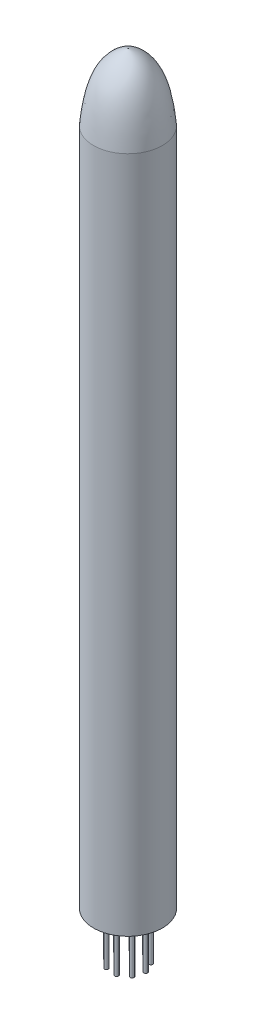
ISO-10303-21;
HEADER;
FILE_DESCRIPTION(('STEP AP214'),'2;1');
FILE_NAME('part.step','',(''),(''),'','','');
FILE_SCHEMA(('AUTOMOTIVE_DESIGN { 1 0 10303 214 1 1 1 1 }'));
ENDSEC;
DATA;
#1=APPLICATION_CONTEXT('core data for automotive mechanical design processes');
#2=APPLICATION_PROTOCOL_DEFINITION('international standard','automotive_design',2000,#1);
#3=PRODUCT_CONTEXT('',#1,'mechanical');
#4=PRODUCT('Part','Part','',(#3));
#5=PRODUCT_RELATED_PRODUCT_CATEGORY('part','',(#4));
#6=PRODUCT_DEFINITION_FORMATION('','',#4);
#7=PRODUCT_DEFINITION_CONTEXT('part definition',#1,'design');
#8=PRODUCT_DEFINITION('design','',#6,#7);
#9=PRODUCT_DEFINITION_SHAPE('','',#8);
#10=(LENGTH_UNIT() NAMED_UNIT(*) SI_UNIT(.MILLI.,.METRE.));
#11=(NAMED_UNIT(*) PLANE_ANGLE_UNIT() SI_UNIT($,.RADIAN.));
#12=(NAMED_UNIT(*) SI_UNIT($,.STERADIAN.) SOLID_ANGLE_UNIT());
#13=UNCERTAINTY_MEASURE_WITH_UNIT(LENGTH_MEASURE(1.E-05),#10,'distance_accuracy_value','');
#14=(GEOMETRIC_REPRESENTATION_CONTEXT(3) GLOBAL_UNCERTAINTY_ASSIGNED_CONTEXT((#13)) GLOBAL_UNIT_ASSIGNED_CONTEXT((#10,
#11,#12)) REPRESENTATION_CONTEXT('',''));
#15=CARTESIAN_POINT('',(0.,0.,0.));
#16=DIRECTION('',(0.,0.,1.));
#17=DIRECTION('',(1.,0.,0.));
#18=AXIS2_PLACEMENT_3D('',#15,#16,#17);
#19=CARTESIAN_POINT('',(-3.6,0.,0.));
#20=DIRECTION('',(0.,-1.,0.));
#21=DIRECTION('',(1.,0.,0.));
#22=AXIS2_PLACEMENT_3D('',#19,#20,#21);
#23=PLANE('',#22);
#24=CARTESIAN_POINT('',(1.190992427399,0.,-1.21306926342985));
#25=DIRECTION('',(0.,-1.,0.));
#26=DIRECTION('',(0.17364817766694,0.,0.984807753012206));
#27=AXIS2_PLACEMENT_3D('',#24,#25,#26);
#28=CIRCLE('',#27,0.2);
#29=CARTESIAN_POINT('',(1.22572206293239,0.,-1.01610771282741));
#30=VERTEX_POINT('',#29);
#31=EDGE_CURVE('E142',#30,#30,#28,.T.);
#32=ORIENTED_EDGE('',*,*,#31,.F.);
#33=EDGE_LOOP('',(#32));
#34=FACE_BOUND('',#33,.T.);
#35=CARTESIAN_POINT('',(1.40145368019947,0.,0.962251309303013));
#36=DIRECTION('',(0.,-1.,0.));
#37=DIRECTION('',(-0.939692620785906,0.,0.342020143325676));
#38=AXIS2_PLACEMENT_3D('',#35,#36,#37);
#39=CIRCLE('',#38,0.2);
#40=CARTESIAN_POINT('',(1.21351515604229,0.,1.03065533796815));
#41=VERTEX_POINT('',#40);
#42=EDGE_CURVE('E157',#41,#41,#39,.T.);
#43=ORIENTED_EDGE('',*,*,#42,.F.);
#44=EDGE_LOOP('',(#43));
#45=FACE_BOUND('',#44,.T.);
#46=CARTESIAN_POINT('',(-0.704272672096509,0.,1.54725563606601));
#47=DIRECTION('',(0.,-1.,0.));
#48=DIRECTION('',(-0.500000000000004,0.,-0.866025403784436));
#49=AXIS2_PLACEMENT_3D('',#46,#47,#48);
#50=CIRCLE('',#49,0.2);
#51=CARTESIAN_POINT('',(-0.80427267209651,0.,1.37405055530913));
#52=VERTEX_POINT('',#51);
#53=EDGE_CURVE('E169',#52,#52,#50,.T.);
#54=ORIENTED_EDGE('',*,*,#53,.F.);
#55=EDGE_LOOP('',(#54));
#56=FACE_BOUND('',#55,.T.);
#57=CARTESIAN_POINT('',(-1.64604501237982,0.,-0.424895066127521));
#58=DIRECTION('',(0.,-1.,0.));
#59=DIRECTION('',(0.766044443118977,0.,-0.642787609686541));
#60=AXIS2_PLACEMENT_3D('',#57,#58,#59);
#61=CIRCLE('',#60,0.2);
#62=CARTESIAN_POINT('',(-1.49283612375603,0.,-0.55345258806483));
#63=VERTEX_POINT('',#62);
#64=EDGE_CURVE('E181',#63,#63,#61,.T.);
#65=ORIENTED_EDGE('',*,*,#64,.F.);
#66=EDGE_LOOP('',(#65));
#67=FACE_BOUND('',#66,.T.);
#68=CARTESIAN_POINT('',(0.,0.,0.));
#69=DIRECTION('',(0.,1.,0.));
#70=DIRECTION('',(-1.,0.,0.));
#71=AXIS2_PLACEMENT_3D('',#68,#69,#70);
#72=CIRCLE('',#71,3.6);
#73=CARTESIAN_POINT('',(-3.6,0.,0.));
#74=VERTEX_POINT('',#73);
#75=EDGE_CURVE('E46',#74,#74,#72,.T.);
#76=ORIENTED_EDGE('',*,*,#75,.F.);
#77=EDGE_LOOP('',(#76));
#78=FACE_BOUND('',#77,.T.);
#79=CARTESIAN_POINT('',(-0.987826350933557,0.,-1.38354584325974));
#80=DIRECTION('',(0.,-1.,0.));
#81=DIRECTION('',(1.,0.,0.));
#82=AXIS2_PLACEMENT_3D('',#79,#80,#81);
#83=CIRCLE('',#82,0.2);
#84=CARTESIAN_POINT('',(-0.787826350933557,0.,-1.38354584325974));
#85=VERTEX_POINT('',#84);
#86=EDGE_CURVE('E187',#85,#85,#83,.T.);
#87=ORIENTED_EDGE('',*,*,#86,.F.);
#88=EDGE_LOOP('',(#87));
#89=FACE_BOUND('',#88,.T.);
#90=CARTESIAN_POINT('',(-1.53406091878098,0.,0.73256883462842));
#91=DIRECTION('',(0.,-1.,0.));
#92=DIRECTION('',(0.173648177666927,0.,-0.984807753012209));
#93=AXIS2_PLACEMENT_3D('',#90,#91,#92);
#94=CIRCLE('',#93,0.2);
#95=CARTESIAN_POINT('',(-1.4993312832476,0.,0.535607284025978));
#96=VERTEX_POINT('',#95);
#97=EDGE_CURVE('E175',#96,#96,#94,.T.);
#98=ORIENTED_EDGE('',*,*,#97,.F.);
#99=EDGE_LOOP('',(#98));
#100=FACE_BOUND('',#99,.T.);
#101=CARTESIAN_POINT('',(0.455052584980816,0.,1.63796432955736));
#102=DIRECTION('',(0.,-1.,0.));
#103=DIRECTION('',(-0.939692620785911,0.,-0.342020143325663));
#104=AXIS2_PLACEMENT_3D('',#101,#102,#103);
#105=CIRCLE('',#104,0.2);
#106=CARTESIAN_POINT('',(0.267114060823634,0.,1.56956030089222));
#107=VERTEX_POINT('',#106);
#108=EDGE_CURVE('E163',#107,#107,#105,.T.);
#109=ORIENTED_EDGE('',*,*,#108,.F.);
#110=EDGE_LOOP('',(#109));
#111=FACE_BOUND('',#110,.T.);
#112=CARTESIAN_POINT('',(1.69209902303007,0.,-0.16370979280629));
#113=DIRECTION('',(0.,-1.,0.));
#114=DIRECTION('',(-0.499999999999992,0.,0.866025403784443));
#115=AXIS2_PLACEMENT_3D('',#112,#113,#114);
#116=CIRCLE('',#115,0.2);
#117=CARTESIAN_POINT('',(1.59209902303007,0.,0.0094952879505989));
#118=VERTEX_POINT('',#117);
#119=EDGE_CURVE('E152',#118,#118,#116,.T.);
#120=ORIENTED_EDGE('',*,*,#119,.F.);
#121=EDGE_LOOP('',(#120));
#122=FACE_BOUND('',#121,.T.);
#123=CARTESIAN_POINT('',(0.132607238581504,0.,-1.69482014393144));
#124=DIRECTION('',(0.,-1.,0.));
#125=DIRECTION('',(0.766044443118986,0.,0.64278760968653));
#126=AXIS2_PLACEMENT_3D('',#123,#124,#125);
#127=CIRCLE('',#126,0.2);
#128=CARTESIAN_POINT('',(0.285816127205301,0.,-1.56626262199413));
#129=VERTEX_POINT('',#128);
#130=EDGE_CURVE('E143',#129,#129,#127,.T.);
#131=ORIENTED_EDGE('',*,*,#130,.F.);
#132=EDGE_LOOP('',(#131));
#133=FACE_BOUND('',#132,.T.);
#134=ADVANCED_FACE('F38',(#34,#45,#56,#67,#78,#89,#100,#111,#122,#133),#23,.T.);
#135=CARTESIAN_POINT('',(0.,78.,0.));
#136=CARTESIAN_POINT('',(-2.93162040251302,77.0762935384002,0.));
#137=CARTESIAN_POINT('',(-3.33793778275533,73.5516801073989,0.));
#138=CARTESIAN_POINT('',(-3.60000000000001,71.,0.));
#139=B_SPLINE_CURVE_WITH_KNOTS('',3,(#135,#136,#137,#138),.UNSPECIFIED.,.F.,.F.,(4,4),(0.,1.),.UNSPECIFIED.);
#140=CARTESIAN_POINT('',(0.,8.26332855790539,0.));
#141=DIRECTION('',(0.,1.,0.));
#142=AXIS1_PLACEMENT('',#140,#141);
#143=SURFACE_OF_REVOLUTION('',#139,#142);
#144=CARTESIAN_POINT('',(0.,71.,0.));
#145=DIRECTION('',(0.,1.,0.));
#146=DIRECTION('',(-1.,0.,0.));
#147=AXIS2_PLACEMENT_3D('',#144,#145,#146);
#148=CIRCLE('',#147,3.6);
#149=CARTESIAN_POINT('',(-3.60000000000001,71.,0.));
#150=VERTEX_POINT('',#149);
#151=EDGE_CURVE('E11',#150,#150,#148,.T.);
#152=ORIENTED_EDGE('',*,*,#151,.T.);
#153=EDGE_LOOP('',(#152));
#154=FACE_BOUND('',#153,.T.);
#155=CARTESIAN_POINT('',(0.,78.,0.));
#156=VERTEX_POINT('',#155);
#157=VERTEX_LOOP('',#156);
#158=FACE_BOUND('',#157,.T.);
#159=ADVANCED_FACE('F40',(#154,#158),#143,.F.);
#160=CARTESIAN_POINT('',(0.,8.26332855790539,0.));
#161=DIRECTION('',(0.,1.,0.));
#162=DIRECTION('',(-1.,0.,0.));
#163=AXIS2_PLACEMENT_3D('',#160,#161,#162);
#164=CYLINDRICAL_SURFACE('',#163,3.6);
#165=ORIENTED_EDGE('',*,*,#75,.T.);
#166=EDGE_LOOP('',(#165));
#167=FACE_BOUND('',#166,.T.);
#168=ORIENTED_EDGE('',*,*,#151,.F.);
#169=EDGE_LOOP('',(#168));
#170=FACE_BOUND('',#169,.T.);
#171=ADVANCED_FACE('F50',(#167,#170),#164,.T.);
#172=CARTESIAN_POINT('',(-0.987826350933556,-5.,-1.38354584325974));
#173=DIRECTION('',(0.,1.,0.));
#174=DIRECTION('',(-1.,0.,0.));
#175=AXIS2_PLACEMENT_3D('',#172,#173,#174);
#176=CYLINDRICAL_SURFACE('',#175,0.2);
#177=CARTESIAN_POINT('',(-0.987826350933556,-5.,-1.38354584325974));
#178=DIRECTION('',(0.,-1.,0.));
#179=DIRECTION('',(1.,0.,0.));
#180=AXIS2_PLACEMENT_3D('',#177,#178,#179);
#181=CIRCLE('',#180,0.2);
#182=CARTESIAN_POINT('',(-0.787826350933556,-5.,-1.38354584325974));
#183=VERTEX_POINT('',#182);
#184=EDGE_CURVE('E190',#183,#183,#181,.T.);
#185=ORIENTED_EDGE('',*,*,#184,.F.);
#186=EDGE_LOOP('',(#185));
#187=FACE_BOUND('',#186,.T.);
#188=ORIENTED_EDGE('',*,*,#86,.T.);
#189=EDGE_LOOP('',(#188));
#190=FACE_BOUND('',#189,.T.);
#191=ADVANCED_FACE('F56',(#187,#190),#176,.T.);
#192=CARTESIAN_POINT('',(-0.987826350933556,-5.,-1.38354584325974));
#193=DIRECTION('',(0.,-1.,0.));
#194=DIRECTION('',(1.,0.,0.));
#195=AXIS2_PLACEMENT_3D('',#192,#193,#194);
#196=PLANE('',#195);
#197=ORIENTED_EDGE('',*,*,#184,.T.);
#198=EDGE_LOOP('',(#197));
#199=FACE_BOUND('',#198,.T.);
#200=ADVANCED_FACE('F69',(#199),#196,.T.);
#201=CARTESIAN_POINT('',(-1.64604501237982,-5.,-0.424895066127522));
#202=DIRECTION('',(0.,1.,0.));
#203=DIRECTION('',(-1.,0.,0.));
#204=AXIS2_PLACEMENT_3D('',#201,#202,#203);
#205=CYLINDRICAL_SURFACE('',#204,0.2);
#206=CARTESIAN_POINT('',(-1.64604501237982,-5.,-0.424895066127522));
#207=DIRECTION('',(0.,-1.,0.));
#208=DIRECTION('',(0.766044443118977,0.,-0.642787609686541));
#209=AXIS2_PLACEMENT_3D('',#206,#207,#208);
#210=CIRCLE('',#209,0.2);
#211=CARTESIAN_POINT('',(-1.49283612375603,-5.,-0.55345258806483));
#212=VERTEX_POINT('',#211);
#213=EDGE_CURVE('E184',#212,#212,#210,.T.);
#214=ORIENTED_EDGE('',*,*,#213,.F.);
#215=EDGE_LOOP('',(#214));
#216=FACE_BOUND('',#215,.T.);
#217=ORIENTED_EDGE('',*,*,#64,.T.);
#218=EDGE_LOOP('',(#217));
#219=FACE_BOUND('',#218,.T.);
#220=ADVANCED_FACE('F73',(#216,#219),#205,.T.);
#221=CARTESIAN_POINT('',(-1.64604501237982,-5.,-0.424895066127522));
#222=DIRECTION('',(0.,-1.,0.));
#223=DIRECTION('',(0.766044443118977,0.,-0.642787609686541));
#224=AXIS2_PLACEMENT_3D('',#221,#222,#223);
#225=PLANE('',#224);
#226=ORIENTED_EDGE('',*,*,#213,.T.);
#227=EDGE_LOOP('',(#226));
#228=FACE_BOUND('',#227,.T.);
#229=ADVANCED_FACE('F77',(#228),#225,.T.);
#230=CARTESIAN_POINT('',(-1.53406091878098,-5.,0.732568834628419));
#231=DIRECTION('',(0.,1.,0.));
#232=DIRECTION('',(0.,0.,1.));
#233=AXIS2_PLACEMENT_3D('',#230,#231,#232);
#234=CYLINDRICAL_SURFACE('',#233,0.2);
#235=CARTESIAN_POINT('',(-1.53406091878098,-5.,0.732568834628419));
#236=DIRECTION('',(0.,-1.,0.));
#237=DIRECTION('',(0.173648177666927,0.,-0.984807753012209));
#238=AXIS2_PLACEMENT_3D('',#235,#236,#237);
#239=CIRCLE('',#238,0.2);
#240=CARTESIAN_POINT('',(-1.4993312832476,-5.,0.535607284025977));
#241=VERTEX_POINT('',#240);
#242=EDGE_CURVE('E178',#241,#241,#239,.T.);
#243=ORIENTED_EDGE('',*,*,#242,.F.);
#244=EDGE_LOOP('',(#243));
#245=FACE_BOUND('',#244,.T.);
#246=ORIENTED_EDGE('',*,*,#97,.T.);
#247=EDGE_LOOP('',(#246));
#248=FACE_BOUND('',#247,.T.);
#249=ADVANCED_FACE('F81',(#245,#248),#234,.T.);
#250=CARTESIAN_POINT('',(-1.53406091878098,-5.,0.732568834628419));
#251=DIRECTION('',(0.,-1.,0.));
#252=DIRECTION('',(0.173648177666927,0.,-0.984807753012209));
#253=AXIS2_PLACEMENT_3D('',#250,#251,#252);
#254=PLANE('',#253);
#255=ORIENTED_EDGE('',*,*,#242,.T.);
#256=EDGE_LOOP('',(#255));
#257=FACE_BOUND('',#256,.T.);
#258=ADVANCED_FACE('F85',(#257),#254,.T.);
#259=CARTESIAN_POINT('',(-0.704272672096509,-5.,1.54725563606601));
#260=DIRECTION('',(0.,1.,0.));
#261=DIRECTION('',(0.,0.,1.));
#262=AXIS2_PLACEMENT_3D('',#259,#260,#261);
#263=CYLINDRICAL_SURFACE('',#262,0.2);
#264=CARTESIAN_POINT('',(-0.704272672096509,-5.,1.54725563606601));
#265=DIRECTION('',(0.,-1.,0.));
#266=DIRECTION('',(-0.500000000000004,0.,-0.866025403784436));
#267=AXIS2_PLACEMENT_3D('',#264,#265,#266);
#268=CIRCLE('',#267,0.2);
#269=CARTESIAN_POINT('',(-0.80427267209651,-5.,1.37405055530913));
#270=VERTEX_POINT('',#269);
#271=EDGE_CURVE('E172',#270,#270,#268,.T.);
#272=ORIENTED_EDGE('',*,*,#271,.F.);
#273=EDGE_LOOP('',(#272));
#274=FACE_BOUND('',#273,.T.);
#275=ORIENTED_EDGE('',*,*,#53,.T.);
#276=EDGE_LOOP('',(#275));
#277=FACE_BOUND('',#276,.T.);
#278=ADVANCED_FACE('F89',(#274,#277),#263,.T.);
#279=CARTESIAN_POINT('',(-0.704272672096509,-5.,1.54725563606601));
#280=DIRECTION('',(0.,-1.,0.));
#281=DIRECTION('',(-0.500000000000004,0.,-0.866025403784436));
#282=AXIS2_PLACEMENT_3D('',#279,#280,#281);
#283=PLANE('',#282);
#284=ORIENTED_EDGE('',*,*,#271,.T.);
#285=EDGE_LOOP('',(#284));
#286=FACE_BOUND('',#285,.T.);
#287=ADVANCED_FACE('F93',(#286),#283,.T.);
#288=CARTESIAN_POINT('',(0.455052584980816,-5.,1.63796432955736));
#289=DIRECTION('',(0.,1.,0.));
#290=DIRECTION('',(-1.,0.,0.));
#291=AXIS2_PLACEMENT_3D('',#288,#289,#290);
#292=CYLINDRICAL_SURFACE('',#291,0.2);
#293=CARTESIAN_POINT('',(0.455052584980816,-5.,1.63796432955736));
#294=DIRECTION('',(0.,-1.,0.));
#295=DIRECTION('',(-0.939692620785911,0.,-0.342020143325663));
#296=AXIS2_PLACEMENT_3D('',#293,#294,#295);
#297=CIRCLE('',#296,0.2);
#298=CARTESIAN_POINT('',(0.267114060823633,-5.,1.56956030089222));
#299=VERTEX_POINT('',#298);
#300=EDGE_CURVE('E166',#299,#299,#297,.T.);
#301=ORIENTED_EDGE('',*,*,#300,.F.);
#302=EDGE_LOOP('',(#301));
#303=FACE_BOUND('',#302,.T.);
#304=ORIENTED_EDGE('',*,*,#108,.T.);
#305=EDGE_LOOP('',(#304));
#306=FACE_BOUND('',#305,.T.);
#307=ADVANCED_FACE('F97',(#303,#306),#292,.T.);
#308=CARTESIAN_POINT('',(0.455052584980816,-5.,1.63796432955736));
#309=DIRECTION('',(0.,-1.,0.));
#310=DIRECTION('',(-0.939692620785911,0.,-0.342020143325663));
#311=AXIS2_PLACEMENT_3D('',#308,#309,#310);
#312=PLANE('',#311);
#313=ORIENTED_EDGE('',*,*,#300,.T.);
#314=EDGE_LOOP('',(#313));
#315=FACE_BOUND('',#314,.T.);
#316=ADVANCED_FACE('F101',(#315),#312,.T.);
#317=CARTESIAN_POINT('',(1.40145368019947,-5.,0.962251309303013));
#318=DIRECTION('',(0.,1.,0.));
#319=DIRECTION('',(-1.,0.,0.));
#320=AXIS2_PLACEMENT_3D('',#317,#318,#319);
#321=CYLINDRICAL_SURFACE('',#320,0.2);
#322=CARTESIAN_POINT('',(1.40145368019947,-5.,0.962251309303013));
#323=DIRECTION('',(0.,-1.,0.));
#324=DIRECTION('',(-0.939692620785906,0.,0.342020143325676));
#325=AXIS2_PLACEMENT_3D('',#322,#323,#324);
#326=CIRCLE('',#325,0.2);
#327=CARTESIAN_POINT('',(1.21351515604229,-5.,1.03065533796815));
#328=VERTEX_POINT('',#327);
#329=EDGE_CURVE('E160',#328,#328,#326,.T.);
#330=ORIENTED_EDGE('',*,*,#329,.F.);
#331=EDGE_LOOP('',(#330));
#332=FACE_BOUND('',#331,.T.);
#333=ORIENTED_EDGE('',*,*,#42,.T.);
#334=EDGE_LOOP('',(#333));
#335=FACE_BOUND('',#334,.T.);
#336=ADVANCED_FACE('F105',(#332,#335),#321,.T.);
#337=CARTESIAN_POINT('',(1.40145368019947,-5.,0.962251309303013));
#338=DIRECTION('',(0.,-1.,0.));
#339=DIRECTION('',(-0.939692620785906,0.,0.342020143325676));
#340=AXIS2_PLACEMENT_3D('',#337,#338,#339);
#341=PLANE('',#340);
#342=ORIENTED_EDGE('',*,*,#329,.T.);
#343=EDGE_LOOP('',(#342));
#344=FACE_BOUND('',#343,.T.);
#345=ADVANCED_FACE('F109',(#344),#341,.T.);
#346=CARTESIAN_POINT('',(1.69209902303007,-5.,-0.163709792806289));
#347=DIRECTION('',(0.,1.,0.));
#348=DIRECTION('',(0.,0.,1.));
#349=AXIS2_PLACEMENT_3D('',#346,#347,#348);
#350=CYLINDRICAL_SURFACE('',#349,0.2);
#351=CARTESIAN_POINT('',(1.69209902303007,-5.,-0.163709792806289));
#352=DIRECTION('',(0.,-1.,0.));
#353=DIRECTION('',(-0.499999999999992,0.,0.866025403784443));
#354=AXIS2_PLACEMENT_3D('',#351,#352,#353);
#355=CIRCLE('',#354,0.2);
#356=CARTESIAN_POINT('',(1.59209902303007,-5.,0.00949528795059947));
#357=VERTEX_POINT('',#356);
#358=EDGE_CURVE('E154',#357,#357,#355,.T.);
#359=ORIENTED_EDGE('',*,*,#358,.F.);
#360=EDGE_LOOP('',(#359));
#361=FACE_BOUND('',#360,.T.);
#362=ORIENTED_EDGE('',*,*,#119,.T.);
#363=EDGE_LOOP('',(#362));
#364=FACE_BOUND('',#363,.T.);
#365=ADVANCED_FACE('F113',(#361,#364),#350,.T.);
#366=CARTESIAN_POINT('',(1.69209902303007,-5.,-0.163709792806289));
#367=DIRECTION('',(0.,-1.,0.));
#368=DIRECTION('',(-0.499999999999992,0.,0.866025403784443));
#369=AXIS2_PLACEMENT_3D('',#366,#367,#368);
#370=PLANE('',#369);
#371=ORIENTED_EDGE('',*,*,#358,.T.);
#372=EDGE_LOOP('',(#371));
#373=FACE_BOUND('',#372,.T.);
#374=ADVANCED_FACE('F117',(#373),#370,.T.);
#375=CARTESIAN_POINT('',(1.190992427399,-5.,-1.21306926342985));
#376=DIRECTION('',(0.,1.,0.));
#377=DIRECTION('',(0.,0.,1.));
#378=AXIS2_PLACEMENT_3D('',#375,#376,#377);
#379=CYLINDRICAL_SURFACE('',#378,0.2);
#380=CARTESIAN_POINT('',(1.190992427399,-5.,-1.21306926342985));
#381=DIRECTION('',(0.,-1.,0.));
#382=DIRECTION('',(0.17364817766694,0.,0.984807753012206));
#383=AXIS2_PLACEMENT_3D('',#380,#381,#382);
#384=CIRCLE('',#383,0.2);
#385=CARTESIAN_POINT('',(1.22572206293239,-5.,-1.0161077128274));
#386=VERTEX_POINT('',#385);
#387=EDGE_CURVE('E146',#386,#386,#384,.T.);
#388=ORIENTED_EDGE('',*,*,#387,.F.);
#389=EDGE_LOOP('',(#388));
#390=FACE_BOUND('',#389,.T.);
#391=ORIENTED_EDGE('',*,*,#31,.T.);
#392=EDGE_LOOP('',(#391));
#393=FACE_BOUND('',#392,.T.);
#394=ADVANCED_FACE('F121',(#390,#393),#379,.T.);
#395=CARTESIAN_POINT('',(1.190992427399,-5.,-1.21306926342985));
#396=DIRECTION('',(0.,-1.,0.));
#397=DIRECTION('',(0.17364817766694,0.,0.984807753012206));
#398=AXIS2_PLACEMENT_3D('',#395,#396,#397);
#399=PLANE('',#398);
#400=ORIENTED_EDGE('',*,*,#387,.T.);
#401=EDGE_LOOP('',(#400));
#402=FACE_BOUND('',#401,.T.);
#403=ADVANCED_FACE('F125',(#402),#399,.T.);
#404=CARTESIAN_POINT('',(0.132607238581504,-5.,-1.69482014393144));
#405=DIRECTION('',(0.,1.,0.));
#406=DIRECTION('',(-1.,0.,0.));
#407=AXIS2_PLACEMENT_3D('',#404,#405,#406);
#408=CYLINDRICAL_SURFACE('',#407,0.2);
#409=CARTESIAN_POINT('',(0.132607238581504,-5.,-1.69482014393144));
#410=DIRECTION('',(0.,-1.,0.));
#411=DIRECTION('',(0.766044443118986,0.,0.64278760968653));
#412=AXIS2_PLACEMENT_3D('',#409,#410,#411);
#413=CIRCLE('',#412,0.2);
#414=CARTESIAN_POINT('',(0.285816127205302,-5.,-1.56626262199413));
#415=VERTEX_POINT('',#414);
#416=EDGE_CURVE('E141',#415,#415,#413,.T.);
#417=ORIENTED_EDGE('',*,*,#416,.F.);
#418=EDGE_LOOP('',(#417));
#419=FACE_BOUND('',#418,.T.);
#420=ORIENTED_EDGE('',*,*,#130,.T.);
#421=EDGE_LOOP('',(#420));
#422=FACE_BOUND('',#421,.T.);
#423=ADVANCED_FACE('F129',(#419,#422),#408,.T.);
#424=CARTESIAN_POINT('',(0.132607238581504,-5.,-1.69482014393144));
#425=DIRECTION('',(0.,-1.,0.));
#426=DIRECTION('',(0.766044443118986,0.,0.64278760968653));
#427=AXIS2_PLACEMENT_3D('',#424,#425,#426);
#428=PLANE('',#427);
#429=ORIENTED_EDGE('',*,*,#416,.T.);
#430=EDGE_LOOP('',(#429));
#431=FACE_BOUND('',#430,.T.);
#432=ADVANCED_FACE('F133',(#431),#428,.T.);
#433=CLOSED_SHELL('',(#134,#159,#171,#191,#200,#220,#229,#249,#258,#278,#287,#307,#316,#336,
#345,#365,#374,#394,#403,#423,#432));
#434=MANIFOLD_SOLID_BREP('B2',#433);
#435=ADVANCED_BREP_SHAPE_REPRESENTATION('',(#18,#434),#14);
#436=SHAPE_DEFINITION_REPRESENTATION(#9,#435);
ENDSEC;
END-ISO-10303-21;
